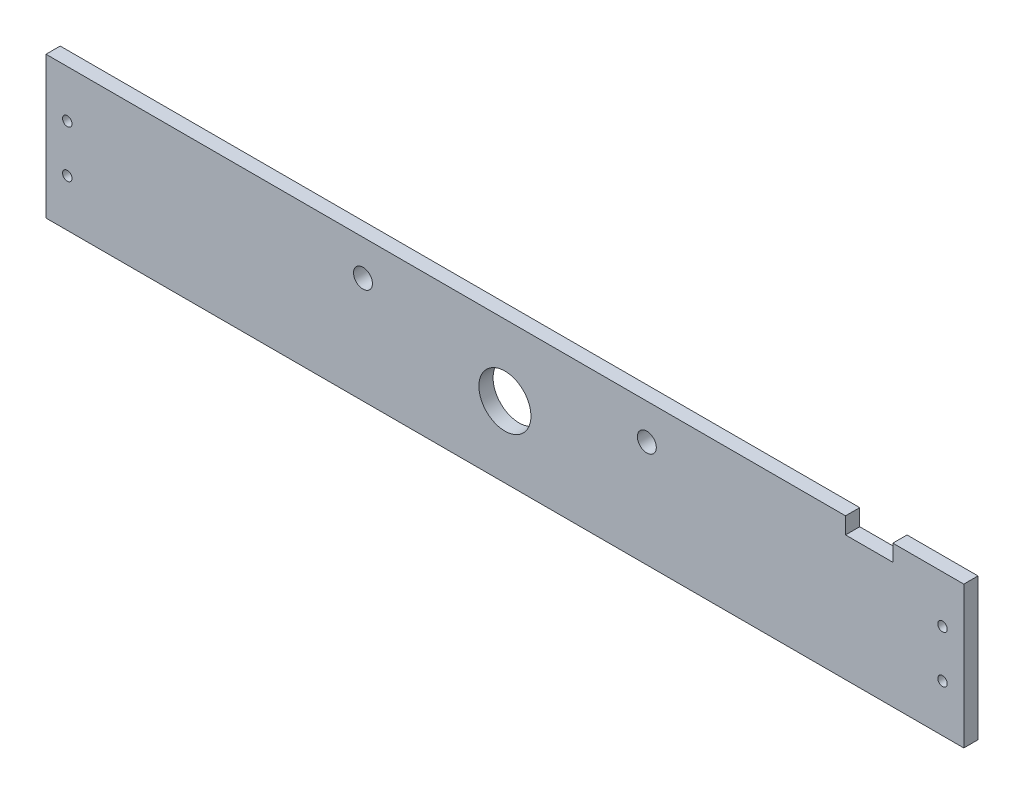
ISO-10303-21;
HEADER;
FILE_DESCRIPTION(('STEP AP214'),'2;1');
FILE_NAME('part.step','',(''),(''),'','','');
FILE_SCHEMA(('AUTOMOTIVE_DESIGN { 1 0 10303 214 1 1 1 1 }'));
ENDSEC;
DATA;
#1=APPLICATION_CONTEXT('core data for automotive mechanical design processes');
#2=APPLICATION_PROTOCOL_DEFINITION('international standard','automotive_design',2000,#1);
#3=PRODUCT_CONTEXT('',#1,'mechanical');
#4=PRODUCT('Part','Part','',(#3));
#5=PRODUCT_RELATED_PRODUCT_CATEGORY('part','',(#4));
#6=PRODUCT_DEFINITION_FORMATION('','',#4);
#7=PRODUCT_DEFINITION_CONTEXT('part definition',#1,'design');
#8=PRODUCT_DEFINITION('design','',#6,#7);
#9=PRODUCT_DEFINITION_SHAPE('','',#8);
#10=(LENGTH_UNIT() NAMED_UNIT(*) SI_UNIT(.MILLI.,.METRE.));
#11=(NAMED_UNIT(*) PLANE_ANGLE_UNIT() SI_UNIT($,.RADIAN.));
#12=(NAMED_UNIT(*) SI_UNIT($,.STERADIAN.) SOLID_ANGLE_UNIT());
#13=UNCERTAINTY_MEASURE_WITH_UNIT(LENGTH_MEASURE(1.E-05),#10,'distance_accuracy_value','');
#14=(GEOMETRIC_REPRESENTATION_CONTEXT(3) GLOBAL_UNCERTAINTY_ASSIGNED_CONTEXT((#13)) GLOBAL_UNIT_ASSIGNED_CONTEXT((#10,
#11,#12)) REPRESENTATION_CONTEXT('',''));
#15=CARTESIAN_POINT('',(0.,0.,0.));
#16=DIRECTION('',(0.,0.,1.));
#17=DIRECTION('',(1.,0.,0.));
#18=AXIS2_PLACEMENT_3D('',#15,#16,#17);
#19=CARTESIAN_POINT('',(144.,0.,6.));
#20=DIRECTION('',(1.,0.,0.));
#21=DIRECTION('',(0.,0.,-1.));
#22=AXIS2_PLACEMENT_3D('',#19,#20,#21);
#23=PLANE('',#22);
#24=DIRECTION('',(0.,-1.,0.));
#25=VECTOR('',#24,1.);
#26=CARTESIAN_POINT('',(144.,0.,0.));
#27=LINE('',#26,#25);
#28=CARTESIAN_POINT('',(144.,29.9999999999996,0.));
#29=VERTEX_POINT('',#28);
#30=CARTESIAN_POINT('',(144.,22.9999999999996,0.));
#31=VERTEX_POINT('',#30);
#32=EDGE_CURVE('E196',#29,#31,#27,.T.);
#33=ORIENTED_EDGE('',*,*,#32,.F.);
#34=DIRECTION('',(0.,0.,-1.));
#35=VECTOR('',#34,1.);
#36=CARTESIAN_POINT('',(144.,29.9999999999996,6.));
#37=LINE('',#36,#35);
#38=CARTESIAN_POINT('',(144.,29.9999999999996,6.));
#39=VERTEX_POINT('',#38);
#40=EDGE_CURVE('E13',#39,#29,#37,.T.);
#41=ORIENTED_EDGE('',*,*,#40,.F.);
#42=DIRECTION('',(0.,-1.,0.));
#43=VECTOR('',#42,1.);
#44=CARTESIAN_POINT('',(144.,0.,6.));
#45=LINE('',#44,#43);
#46=CARTESIAN_POINT('',(144.,22.9999999999996,6.));
#47=VERTEX_POINT('',#46);
#48=EDGE_CURVE('E145',#39,#47,#45,.T.);
#49=ORIENTED_EDGE('',*,*,#48,.T.);
#50=DIRECTION('',(0.,0.,-1.));
#51=VECTOR('',#50,1.);
#52=CARTESIAN_POINT('',(144.,22.9999999999996,6.));
#53=LINE('',#52,#51);
#54=EDGE_CURVE('E97',#47,#31,#53,.T.);
#55=ORIENTED_EDGE('',*,*,#54,.T.);
#56=EDGE_LOOP('',(#33,#41,#49,#55));
#57=FACE_BOUND('',#56,.T.);
#58=ADVANCED_FACE('F45',(#57),#23,.T.);
#59=CARTESIAN_POINT('',(0.,29.9999999999996,6.));
#60=DIRECTION('',(0.,1.,0.));
#61=DIRECTION('',(0.,0.,1.));
#62=AXIS2_PLACEMENT_3D('',#59,#60,#61);
#63=PLANE('',#62);
#64=DIRECTION('',(1.,0.,0.));
#65=VECTOR('',#64,1.);
#66=CARTESIAN_POINT('',(0.,29.9999999999996,0.));
#67=LINE('',#66,#65);
#68=CARTESIAN_POINT('',(-194.,29.9999999999996,0.));
#69=VERTEX_POINT('',#68);
#70=EDGE_CURVE('E190',#69,#29,#67,.T.);
#71=ORIENTED_EDGE('',*,*,#70,.F.);
#72=DIRECTION('',(0.,0.,-1.));
#73=VECTOR('',#72,1.);
#74=CARTESIAN_POINT('',(-194.,29.9999999999996,6.));
#75=LINE('',#74,#73);
#76=CARTESIAN_POINT('',(-194.,29.9999999999996,6.));
#77=VERTEX_POINT('',#76);
#78=EDGE_CURVE('E54',#77,#69,#75,.T.);
#79=ORIENTED_EDGE('',*,*,#78,.F.);
#80=DIRECTION('',(1.,0.,0.));
#81=VECTOR('',#80,1.);
#82=CARTESIAN_POINT('',(0.,29.9999999999996,6.));
#83=LINE('',#82,#81);
#84=EDGE_CURVE('E138',#77,#39,#83,.T.);
#85=ORIENTED_EDGE('',*,*,#84,.T.);
#86=ORIENTED_EDGE('',*,*,#40,.T.);
#87=EDGE_LOOP('',(#71,#79,#85,#86));
#88=FACE_BOUND('',#87,.T.);
#89=ADVANCED_FACE('F195',(#88),#63,.T.);
#90=CARTESIAN_POINT('',(-194.,0.,6.));
#91=DIRECTION('',(1.,0.,0.));
#92=DIRECTION('',(0.,0.,-1.));
#93=AXIS2_PLACEMENT_3D('',#90,#91,#92);
#94=PLANE('',#93);
#95=DIRECTION('',(0.,-1.,0.));
#96=VECTOR('',#95,1.);
#97=CARTESIAN_POINT('',(-194.,0.,0.));
#98=LINE('',#97,#96);
#99=CARTESIAN_POINT('',(-194.,-30.0000000000002,0.));
#100=VERTEX_POINT('',#99);
#101=EDGE_CURVE('E185',#69,#100,#98,.T.);
#102=ORIENTED_EDGE('',*,*,#101,.T.);
#103=DIRECTION('',(0.,0.,-1.));
#104=VECTOR('',#103,1.);
#105=CARTESIAN_POINT('',(-194.,-30.0000000000002,6.));
#106=LINE('',#105,#104);
#107=CARTESIAN_POINT('',(-194.,-30.0000000000002,6.));
#108=VERTEX_POINT('',#107);
#109=EDGE_CURVE('E177',#108,#100,#106,.T.);
#110=ORIENTED_EDGE('',*,*,#109,.F.);
#111=DIRECTION('',(0.,-1.,0.));
#112=VECTOR('',#111,1.);
#113=CARTESIAN_POINT('',(-194.,0.,6.));
#114=LINE('',#113,#112);
#115=EDGE_CURVE('E144',#77,#108,#114,.T.);
#116=ORIENTED_EDGE('',*,*,#115,.F.);
#117=ORIENTED_EDGE('',*,*,#78,.T.);
#118=EDGE_LOOP('',(#102,#110,#116,#117));
#119=FACE_BOUND('',#118,.T.);
#120=ADVANCED_FACE('F183',(#119),#94,.F.);
#121=CARTESIAN_POINT('',(0.,-30.0000000000002,6.));
#122=DIRECTION('',(0.,1.,0.));
#123=DIRECTION('',(0.,0.,1.));
#124=AXIS2_PLACEMENT_3D('',#121,#122,#123);
#125=PLANE('',#124);
#126=DIRECTION('',(1.,0.,0.));
#127=VECTOR('',#126,1.);
#128=CARTESIAN_POINT('',(0.,-30.0000000000002,0.));
#129=LINE('',#128,#127);
#130=CARTESIAN_POINT('',(194.,-30.0000000000002,0.));
#131=VERTEX_POINT('',#130);
#132=EDGE_CURVE('E193',#100,#131,#129,.T.);
#133=ORIENTED_EDGE('',*,*,#132,.T.);
#134=DIRECTION('',(0.,0.,-1.));
#135=VECTOR('',#134,1.);
#136=CARTESIAN_POINT('',(194.,-30.0000000000002,6.));
#137=LINE('',#136,#135);
#138=CARTESIAN_POINT('',(194.,-30.0000000000002,6.));
#139=VERTEX_POINT('',#138);
#140=EDGE_CURVE('E175',#139,#131,#137,.T.);
#141=ORIENTED_EDGE('',*,*,#140,.F.);
#142=DIRECTION('',(1.,0.,0.));
#143=VECTOR('',#142,1.);
#144=CARTESIAN_POINT('',(0.,-30.0000000000002,6.));
#145=LINE('',#144,#143);
#146=EDGE_CURVE('E139',#108,#139,#145,.T.);
#147=ORIENTED_EDGE('',*,*,#146,.F.);
#148=ORIENTED_EDGE('',*,*,#109,.T.);
#149=EDGE_LOOP('',(#133,#141,#147,#148));
#150=FACE_BOUND('',#149,.T.);
#151=ADVANCED_FACE('F283',(#150),#125,.F.);
#152=CARTESIAN_POINT('',(194.,0.,6.));
#153=DIRECTION('',(1.,0.,0.));
#154=DIRECTION('',(0.,0.,-1.));
#155=AXIS2_PLACEMENT_3D('',#152,#153,#154);
#156=PLANE('',#155);
#157=DIRECTION('',(0.,-1.,0.));
#158=VECTOR('',#157,1.);
#159=CARTESIAN_POINT('',(194.,0.,0.));
#160=LINE('',#159,#158);
#161=CARTESIAN_POINT('',(194.,29.9999999999996,0.));
#162=VERTEX_POINT('',#161);
#163=EDGE_CURVE('E201',#162,#131,#160,.T.);
#164=ORIENTED_EDGE('',*,*,#163,.F.);
#165=DIRECTION('',(0.,0.,-1.));
#166=VECTOR('',#165,1.);
#167=CARTESIAN_POINT('',(194.,29.9999999999996,6.));
#168=LINE('',#167,#166);
#169=CARTESIAN_POINT('',(194.,29.9999999999996,6.));
#170=VERTEX_POINT('',#169);
#171=EDGE_CURVE('E125',#170,#162,#168,.T.);
#172=ORIENTED_EDGE('',*,*,#171,.F.);
#173=DIRECTION('',(0.,-1.,0.));
#174=VECTOR('',#173,1.);
#175=CARTESIAN_POINT('',(194.,0.,6.));
#176=LINE('',#175,#174);
#177=EDGE_CURVE('E136',#170,#139,#176,.T.);
#178=ORIENTED_EDGE('',*,*,#177,.T.);
#179=ORIENTED_EDGE('',*,*,#140,.T.);
#180=EDGE_LOOP('',(#164,#172,#178,#179));
#181=FACE_BOUND('',#180,.T.);
#182=ADVANCED_FACE('F285',(#181),#156,.T.);
#183=CARTESIAN_POINT('',(164.,29.9999999999996,0.));
#184=VERTEX_POINT('',#183);
#185=EDGE_CURVE('E122',#184,#162,#67,.T.);
#186=ORIENTED_EDGE('',*,*,#185,.F.);
#187=DIRECTION('',(0.,0.,-1.));
#188=VECTOR('',#187,1.);
#189=CARTESIAN_POINT('',(164.,29.9999999999996,6.));
#190=LINE('',#189,#188);
#191=CARTESIAN_POINT('',(164.,29.9999999999996,6.));
#192=VERTEX_POINT('',#191);
#193=EDGE_CURVE('E116',#192,#184,#190,.T.);
#194=ORIENTED_EDGE('',*,*,#193,.F.);
#195=EDGE_CURVE('E120',#192,#170,#83,.T.);
#196=ORIENTED_EDGE('',*,*,#195,.T.);
#197=ORIENTED_EDGE('',*,*,#171,.T.);
#198=EDGE_LOOP('',(#186,#194,#196,#197));
#199=FACE_BOUND('',#198,.T.);
#200=ADVANCED_FACE('F118',(#199),#63,.T.);
#201=CARTESIAN_POINT('',(164.,0.,6.));
#202=DIRECTION('',(1.,0.,0.));
#203=DIRECTION('',(0.,0.,-1.));
#204=AXIS2_PLACEMENT_3D('',#201,#202,#203);
#205=PLANE('',#204);
#206=DIRECTION('',(0.,-1.,0.));
#207=VECTOR('',#206,1.);
#208=CARTESIAN_POINT('',(164.,0.,0.));
#209=LINE('',#208,#207);
#210=CARTESIAN_POINT('',(164.,22.9999999999996,0.));
#211=VERTEX_POINT('',#210);
#212=EDGE_CURVE('E200',#184,#211,#209,.T.);
#213=ORIENTED_EDGE('',*,*,#212,.T.);
#214=DIRECTION('',(0.,0.,-1.));
#215=VECTOR('',#214,1.);
#216=CARTESIAN_POINT('',(164.,22.9999999999996,6.));
#217=LINE('',#216,#215);
#218=CARTESIAN_POINT('',(164.,22.9999999999996,6.));
#219=VERTEX_POINT('',#218);
#220=EDGE_CURVE('E126',#219,#211,#217,.T.);
#221=ORIENTED_EDGE('',*,*,#220,.F.);
#222=DIRECTION('',(0.,-1.,0.));
#223=VECTOR('',#222,1.);
#224=CARTESIAN_POINT('',(164.,0.,6.));
#225=LINE('',#224,#223);
#226=EDGE_CURVE('E129',#192,#219,#225,.T.);
#227=ORIENTED_EDGE('',*,*,#226,.F.);
#228=ORIENTED_EDGE('',*,*,#193,.T.);
#229=EDGE_LOOP('',(#213,#221,#227,#228));
#230=FACE_BOUND('',#229,.T.);
#231=ADVANCED_FACE('F130',(#230),#205,.F.);
#232=CARTESIAN_POINT('',(-184.999999999997,-10.0000000000005,6.));
#233=DIRECTION('',(0.,0.,-1.));
#234=DIRECTION('',(-1.,0.,0.));
#235=AXIS2_PLACEMENT_3D('',#232,#233,#234);
#236=CYLINDRICAL_SURFACE('',#235,1.99999999999997);
#237=CARTESIAN_POINT('',(-184.999999999997,-10.0000000000005,6.));
#238=DIRECTION('',(0.,0.,1.));
#239=DIRECTION('',(1.,0.,0.));
#240=AXIS2_PLACEMENT_3D('',#237,#238,#239);
#241=CIRCLE('',#240,1.99999999999997);
#242=CARTESIAN_POINT('',(-182.999999999997,-10.0000000000005,6.));
#243=VERTEX_POINT('',#242);
#244=EDGE_CURVE('E272',#243,#243,#241,.T.);
#245=ORIENTED_EDGE('',*,*,#244,.T.);
#246=EDGE_LOOP('',(#245));
#247=FACE_BOUND('',#246,.T.);
#248=CARTESIAN_POINT('',(-184.999999999997,-10.0000000000005,0.));
#249=DIRECTION('',(0.,0.,1.));
#250=DIRECTION('',(1.,0.,0.));
#251=AXIS2_PLACEMENT_3D('',#248,#249,#250);
#252=CIRCLE('',#251,1.99999999999997);
#253=CARTESIAN_POINT('',(-182.999999999997,-10.0000000000005,0.));
#254=VERTEX_POINT('',#253);
#255=EDGE_CURVE('E162',#254,#254,#252,.T.);
#256=ORIENTED_EDGE('',*,*,#255,.F.);
#257=EDGE_LOOP('',(#256));
#258=FACE_BOUND('',#257,.T.);
#259=ADVANCED_FACE('F222',(#247,#258),#236,.F.);
#260=CARTESIAN_POINT('',(-59.9999999999999,14.9999999999996,6.));
#261=DIRECTION('',(0.,0.,-1.));
#262=DIRECTION('',(-1.,0.,0.));
#263=AXIS2_PLACEMENT_3D('',#260,#261,#262);
#264=CYLINDRICAL_SURFACE('',#263,3.99999999999999);
#265=CARTESIAN_POINT('',(-59.9999999999999,14.9999999999996,6.));
#266=DIRECTION('',(0.,0.,1.));
#267=DIRECTION('',(1.,0.,0.));
#268=AXIS2_PLACEMENT_3D('',#265,#266,#267);
#269=CIRCLE('',#268,3.99999999999999);
#270=CARTESIAN_POINT('',(-56.,14.9999999999996,6.));
#271=VERTEX_POINT('',#270);
#272=EDGE_CURVE('E274',#271,#271,#269,.F.);
#273=ORIENTED_EDGE('',*,*,#272,.F.);
#274=EDGE_LOOP('',(#273));
#275=FACE_BOUND('',#274,.T.);
#276=CARTESIAN_POINT('',(-59.9999999999999,14.9999999999996,0.));
#277=DIRECTION('',(0.,0.,1.));
#278=DIRECTION('',(1.,0.,0.));
#279=AXIS2_PLACEMENT_3D('',#276,#277,#278);
#280=CIRCLE('',#279,3.99999999999999);
#281=CARTESIAN_POINT('',(-56.,14.9999999999996,0.));
#282=VERTEX_POINT('',#281);
#283=EDGE_CURVE('E167',#282,#282,#280,.F.);
#284=ORIENTED_EDGE('',*,*,#283,.T.);
#285=EDGE_LOOP('',(#284));
#286=FACE_BOUND('',#285,.T.);
#287=ADVANCED_FACE('F213',(#275,#286),#264,.F.);
#288=CARTESIAN_POINT('',(59.9999999999999,14.9999999999997,6.));
#289=DIRECTION('',(0.,0.,-1.));
#290=DIRECTION('',(-1.,0.,0.));
#291=AXIS2_PLACEMENT_3D('',#288,#289,#290);
#292=CYLINDRICAL_SURFACE('',#291,4.00000000000001);
#293=CARTESIAN_POINT('',(59.9999999999999,14.9999999999997,6.));
#294=DIRECTION('',(0.,0.,1.));
#295=DIRECTION('',(1.,0.,0.));
#296=AXIS2_PLACEMENT_3D('',#293,#294,#295);
#297=CIRCLE('',#296,4.00000000000001);
#298=CARTESIAN_POINT('',(63.9999999999999,14.9999999999997,6.));
#299=VERTEX_POINT('',#298);
#300=EDGE_CURVE('E277',#299,#299,#297,.T.);
#301=ORIENTED_EDGE('',*,*,#300,.T.);
#302=EDGE_LOOP('',(#301));
#303=FACE_BOUND('',#302,.T.);
#304=CARTESIAN_POINT('',(59.9999999999999,14.9999999999997,0.));
#305=DIRECTION('',(0.,0.,1.));
#306=DIRECTION('',(1.,0.,0.));
#307=AXIS2_PLACEMENT_3D('',#304,#305,#306);
#308=CIRCLE('',#307,4.00000000000001);
#309=CARTESIAN_POINT('',(63.9999999999999,14.9999999999997,0.));
#310=VERTEX_POINT('',#309);
#311=EDGE_CURVE('E208',#310,#310,#308,.T.);
#312=ORIENTED_EDGE('',*,*,#311,.F.);
#313=EDGE_LOOP('',(#312));
#314=FACE_BOUND('',#313,.T.);
#315=ADVANCED_FACE('F230',(#303,#314),#292,.F.);
#316=CARTESIAN_POINT('',(0.,22.9999999999996,6.));
#317=DIRECTION('',(0.,-1.,0.));
#318=DIRECTION('',(1.,0.,0.));
#319=AXIS2_PLACEMENT_3D('',#316,#317,#318);
#320=PLANE('',#319);
#321=DIRECTION('',(-1.,0.,0.));
#322=VECTOR('',#321,1.);
#323=CARTESIAN_POINT('',(0.,22.9999999999996,0.));
#324=LINE('',#323,#322);
#325=EDGE_CURVE('E90',#211,#31,#324,.T.);
#326=ORIENTED_EDGE('',*,*,#325,.T.);
#327=ORIENTED_EDGE('',*,*,#54,.F.);
#328=DIRECTION('',(-1.,0.,0.));
#329=VECTOR('',#328,1.);
#330=CARTESIAN_POINT('',(0.,22.9999999999996,6.));
#331=LINE('',#330,#329);
#332=EDGE_CURVE('E62',#219,#47,#331,.T.);
#333=ORIENTED_EDGE('',*,*,#332,.F.);
#334=ORIENTED_EDGE('',*,*,#220,.T.);
#335=EDGE_LOOP('',(#326,#327,#333,#334));
#336=FACE_BOUND('',#335,.T.);
#337=ADVANCED_FACE('F248',(#336),#320,.F.);
#338=CARTESIAN_POINT('',(0.,0.,6.));
#339=DIRECTION('',(0.,0.,-1.));
#340=DIRECTION('',(-1.,0.,0.));
#341=AXIS2_PLACEMENT_3D('',#338,#339,#340);
#342=CYLINDRICAL_SURFACE('',#341,11.);
#343=CARTESIAN_POINT('',(0.,0.,6.));
#344=DIRECTION('',(0.,0.,1.));
#345=DIRECTION('',(1.,0.,0.));
#346=AXIS2_PLACEMENT_3D('',#343,#344,#345);
#347=CIRCLE('',#346,11.);
#348=CARTESIAN_POINT('',(11.,0.,6.));
#349=VERTEX_POINT('',#348);
#350=EDGE_CURVE('E149',#349,#349,#347,.T.);
#351=ORIENTED_EDGE('',*,*,#350,.T.);
#352=EDGE_LOOP('',(#351));
#353=FACE_BOUND('',#352,.T.);
#354=CARTESIAN_POINT('',(0.,0.,0.));
#355=DIRECTION('',(0.,0.,1.));
#356=DIRECTION('',(1.,0.,0.));
#357=AXIS2_PLACEMENT_3D('',#354,#355,#356);
#358=CIRCLE('',#357,11.);
#359=CARTESIAN_POINT('',(11.,0.,0.));
#360=VERTEX_POINT('',#359);
#361=EDGE_CURVE('E198',#360,#360,#358,.T.);
#362=ORIENTED_EDGE('',*,*,#361,.F.);
#363=EDGE_LOOP('',(#362));
#364=FACE_BOUND('',#363,.T.);
#365=ADVANCED_FACE('F245',(#353,#364),#342,.F.);
#366=CARTESIAN_POINT('',(184.999999999997,9.99999999999915,6.));
#367=DIRECTION('',(0.,0.,-1.));
#368=DIRECTION('',(-1.,0.,0.));
#369=AXIS2_PLACEMENT_3D('',#366,#367,#368);
#370=CYLINDRICAL_SURFACE('',#369,2.00000000000002);
#371=CARTESIAN_POINT('',(184.999999999997,9.99999999999915,6.));
#372=DIRECTION('',(0.,0.,1.));
#373=DIRECTION('',(1.,0.,0.));
#374=AXIS2_PLACEMENT_3D('',#371,#372,#373);
#375=CIRCLE('',#374,2.00000000000002);
#376=CARTESIAN_POINT('',(186.999999999997,9.99999999999915,6.));
#377=VERTEX_POINT('',#376);
#378=EDGE_CURVE('E151',#377,#377,#375,.T.);
#379=ORIENTED_EDGE('',*,*,#378,.T.);
#380=EDGE_LOOP('',(#379));
#381=FACE_BOUND('',#380,.T.);
#382=CARTESIAN_POINT('',(184.999999999997,9.99999999999915,0.));
#383=DIRECTION('',(0.,0.,1.));
#384=DIRECTION('',(1.,0.,0.));
#385=AXIS2_PLACEMENT_3D('',#382,#383,#384);
#386=CIRCLE('',#385,2.00000000000002);
#387=CARTESIAN_POINT('',(186.999999999997,9.99999999999915,0.));
#388=VERTEX_POINT('',#387);
#389=EDGE_CURVE('E261',#388,#388,#386,.T.);
#390=ORIENTED_EDGE('',*,*,#389,.F.);
#391=EDGE_LOOP('',(#390));
#392=FACE_BOUND('',#391,.T.);
#393=ADVANCED_FACE('F247',(#381,#392),#370,.F.);
#394=CARTESIAN_POINT('',(184.999999999997,-9.99999999999912,6.));
#395=DIRECTION('',(0.,0.,-1.));
#396=DIRECTION('',(-1.,0.,0.));
#397=AXIS2_PLACEMENT_3D('',#394,#395,#396);
#398=CYLINDRICAL_SURFACE('',#397,2.00000000000002);
#399=CARTESIAN_POINT('',(184.999999999997,-9.99999999999912,6.));
#400=DIRECTION('',(0.,0.,1.));
#401=DIRECTION('',(1.,0.,0.));
#402=AXIS2_PLACEMENT_3D('',#399,#400,#401);
#403=CIRCLE('',#402,2.00000000000002);
#404=CARTESIAN_POINT('',(186.999999999997,-9.99999999999912,6.));
#405=VERTEX_POINT('',#404);
#406=EDGE_CURVE('E156',#405,#405,#403,.F.);
#407=ORIENTED_EDGE('',*,*,#406,.F.);
#408=EDGE_LOOP('',(#407));
#409=FACE_BOUND('',#408,.T.);
#410=CARTESIAN_POINT('',(184.999999999997,-9.99999999999912,0.));
#411=DIRECTION('',(0.,0.,1.));
#412=DIRECTION('',(1.,0.,0.));
#413=AXIS2_PLACEMENT_3D('',#410,#411,#412);
#414=CIRCLE('',#413,2.00000000000002);
#415=CARTESIAN_POINT('',(186.999999999997,-9.99999999999912,0.));
#416=VERTEX_POINT('',#415);
#417=EDGE_CURVE('E263',#416,#416,#414,.F.);
#418=ORIENTED_EDGE('',*,*,#417,.T.);
#419=EDGE_LOOP('',(#418));
#420=FACE_BOUND('',#419,.T.);
#421=ADVANCED_FACE('F47',(#409,#420),#398,.F.);
#422=CARTESIAN_POINT('',(-184.999999999997,9.99999999999782,6.));
#423=DIRECTION('',(0.,0.,-1.));
#424=DIRECTION('',(-1.,0.,0.));
#425=AXIS2_PLACEMENT_3D('',#422,#423,#424);
#426=CYLINDRICAL_SURFACE('',#425,2.00000000000002);
#427=CARTESIAN_POINT('',(-184.999999999997,9.99999999999782,6.));
#428=DIRECTION('',(0.,0.,1.));
#429=DIRECTION('',(1.,0.,0.));
#430=AXIS2_PLACEMENT_3D('',#427,#428,#429);
#431=CIRCLE('',#430,2.00000000000002);
#432=CARTESIAN_POINT('',(-182.999999999997,9.99999999999782,6.));
#433=VERTEX_POINT('',#432);
#434=EDGE_CURVE('E172',#433,#433,#431,.F.);
#435=ORIENTED_EDGE('',*,*,#434,.F.);
#436=EDGE_LOOP('',(#435));
#437=FACE_BOUND('',#436,.T.);
#438=CARTESIAN_POINT('',(-184.999999999997,9.99999999999782,0.));
#439=DIRECTION('',(0.,0.,1.));
#440=DIRECTION('',(1.,0.,0.));
#441=AXIS2_PLACEMENT_3D('',#438,#439,#440);
#442=CIRCLE('',#441,2.00000000000002);
#443=CARTESIAN_POINT('',(-182.999999999997,9.99999999999782,0.));
#444=VERTEX_POINT('',#443);
#445=EDGE_CURVE('E158',#444,#444,#442,.F.);
#446=ORIENTED_EDGE('',*,*,#445,.T.);
#447=EDGE_LOOP('',(#446));
#448=FACE_BOUND('',#447,.T.);
#449=ADVANCED_FACE('F255',(#437,#448),#426,.F.);
#450=CARTESIAN_POINT('',(0.,0.,6.));
#451=DIRECTION('',(0.,0.,1.));
#452=DIRECTION('',(1.,0.,0.));
#453=AXIS2_PLACEMENT_3D('',#450,#451,#452);
#454=PLANE('',#453);
#455=ORIENTED_EDGE('',*,*,#406,.T.);
#456=EDGE_LOOP('',(#455));
#457=FACE_BOUND('',#456,.T.);
#458=ORIENTED_EDGE('',*,*,#378,.F.);
#459=EDGE_LOOP('',(#458));
#460=FACE_BOUND('',#459,.T.);
#461=ORIENTED_EDGE('',*,*,#350,.F.);
#462=EDGE_LOOP('',(#461));
#463=FACE_BOUND('',#462,.T.);
#464=ORIENTED_EDGE('',*,*,#48,.F.);
#465=ORIENTED_EDGE('',*,*,#84,.F.);
#466=ORIENTED_EDGE('',*,*,#115,.T.);
#467=ORIENTED_EDGE('',*,*,#146,.T.);
#468=ORIENTED_EDGE('',*,*,#177,.F.);
#469=ORIENTED_EDGE('',*,*,#195,.F.);
#470=ORIENTED_EDGE('',*,*,#226,.T.);
#471=ORIENTED_EDGE('',*,*,#332,.T.);
#472=EDGE_LOOP('',(#464,#465,#466,#467,#468,#469,#470,#471));
#473=FACE_BOUND('',#472,.T.);
#474=ORIENTED_EDGE('',*,*,#300,.F.);
#475=EDGE_LOOP('',(#474));
#476=FACE_BOUND('',#475,.T.);
#477=ORIENTED_EDGE('',*,*,#272,.T.);
#478=EDGE_LOOP('',(#477));
#479=FACE_BOUND('',#478,.T.);
#480=ORIENTED_EDGE('',*,*,#244,.F.);
#481=EDGE_LOOP('',(#480));
#482=FACE_BOUND('',#481,.T.);
#483=ORIENTED_EDGE('',*,*,#434,.T.);
#484=EDGE_LOOP('',(#483));
#485=FACE_BOUND('',#484,.T.);
#486=ADVANCED_FACE('F133',(#457,#460,#463,#473,#476,#479,#482,#485),#454,.T.);
#487=CARTESIAN_POINT('',(0.,0.,0.));
#488=DIRECTION('',(0.,0.,1.));
#489=DIRECTION('',(1.,0.,0.));
#490=AXIS2_PLACEMENT_3D('',#487,#488,#489);
#491=PLANE('',#490);
#492=ORIENTED_EDGE('',*,*,#417,.F.);
#493=EDGE_LOOP('',(#492));
#494=FACE_BOUND('',#493,.T.);
#495=ORIENTED_EDGE('',*,*,#389,.T.);
#496=EDGE_LOOP('',(#495));
#497=FACE_BOUND('',#496,.T.);
#498=ORIENTED_EDGE('',*,*,#361,.T.);
#499=EDGE_LOOP('',(#498));
#500=FACE_BOUND('',#499,.T.);
#501=ORIENTED_EDGE('',*,*,#32,.T.);
#502=ORIENTED_EDGE('',*,*,#325,.F.);
#503=ORIENTED_EDGE('',*,*,#212,.F.);
#504=ORIENTED_EDGE('',*,*,#185,.T.);
#505=ORIENTED_EDGE('',*,*,#163,.T.);
#506=ORIENTED_EDGE('',*,*,#132,.F.);
#507=ORIENTED_EDGE('',*,*,#101,.F.);
#508=ORIENTED_EDGE('',*,*,#70,.T.);
#509=EDGE_LOOP('',(#501,#502,#503,#504,#505,#506,#507,#508));
#510=FACE_BOUND('',#509,.T.);
#511=ORIENTED_EDGE('',*,*,#311,.T.);
#512=EDGE_LOOP('',(#511));
#513=FACE_BOUND('',#512,.T.);
#514=ORIENTED_EDGE('',*,*,#283,.F.);
#515=EDGE_LOOP('',(#514));
#516=FACE_BOUND('',#515,.T.);
#517=ORIENTED_EDGE('',*,*,#255,.T.);
#518=EDGE_LOOP('',(#517));
#519=FACE_BOUND('',#518,.T.);
#520=ORIENTED_EDGE('',*,*,#445,.F.);
#521=EDGE_LOOP('',(#520));
#522=FACE_BOUND('',#521,.T.);
#523=ADVANCED_FACE('F188',(#494,#497,#500,#510,#513,#516,#519,#522),#491,.F.);
#524=CLOSED_SHELL('',(#58,#89,#120,#151,#182,#200,#231,#259,#287,#315,#337,#365,#393,#421,#449,
#486,#523));
#525=MANIFOLD_SOLID_BREP('B2',#524);
#526=ADVANCED_BREP_SHAPE_REPRESENTATION('',(#18,#525),#14);
#527=SHAPE_DEFINITION_REPRESENTATION(#9,#526);
ENDSEC;
END-ISO-10303-21;
